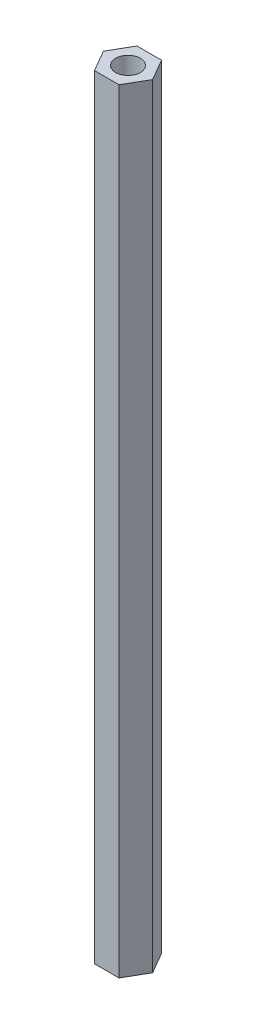
ISO-10303-21;
HEADER;
FILE_DESCRIPTION(('STEP AP214'),'2;1');
FILE_NAME('part.step','',(''),(''),'','','');
FILE_SCHEMA(('AUTOMOTIVE_DESIGN { 1 0 10303 214 1 1 1 1 }'));
ENDSEC;
DATA;
#1=APPLICATION_CONTEXT('core data for automotive mechanical design processes');
#2=APPLICATION_PROTOCOL_DEFINITION('international standard','automotive_design',2000,#1);
#3=PRODUCT_CONTEXT('',#1,'mechanical');
#4=PRODUCT('Part','Part','',(#3));
#5=PRODUCT_RELATED_PRODUCT_CATEGORY('part','',(#4));
#6=PRODUCT_DEFINITION_FORMATION('','',#4);
#7=PRODUCT_DEFINITION_CONTEXT('part definition',#1,'design');
#8=PRODUCT_DEFINITION('design','',#6,#7);
#9=PRODUCT_DEFINITION_SHAPE('','',#8);
#10=(LENGTH_UNIT() NAMED_UNIT(*) SI_UNIT(.MILLI.,.METRE.));
#11=(NAMED_UNIT(*) PLANE_ANGLE_UNIT() SI_UNIT($,.RADIAN.));
#12=(NAMED_UNIT(*) SI_UNIT($,.STERADIAN.) SOLID_ANGLE_UNIT());
#13=UNCERTAINTY_MEASURE_WITH_UNIT(LENGTH_MEASURE(1.E-05),#10,'distance_accuracy_value','');
#14=(GEOMETRIC_REPRESENTATION_CONTEXT(3) GLOBAL_UNCERTAINTY_ASSIGNED_CONTEXT((#13)) GLOBAL_UNIT_ASSIGNED_CONTEXT((#10,
#11,#12)) REPRESENTATION_CONTEXT('',''));
#15=CARTESIAN_POINT('',(0.,0.,0.));
#16=DIRECTION('',(0.,0.,1.));
#17=DIRECTION('',(1.,0.,0.));
#18=AXIS2_PLACEMENT_3D('',#15,#16,#17);
#19=CARTESIAN_POINT('',(1.58771324027147,100.,2.75));
#20=DIRECTION('',(-0.866025403784439,0.,-0.5));
#21=DIRECTION('',(-0.5,0.,0.866025403784439));
#22=AXIS2_PLACEMENT_3D('',#19,#20,#21);
#23=PLANE('',#22);
#24=DIRECTION('',(0.5,0.,-0.866025403784439));
#25=VECTOR('',#24,1.);
#26=CARTESIAN_POINT('',(1.58771324027147,0.,2.75));
#27=LINE('',#26,#25);
#28=CARTESIAN_POINT('',(1.58771324027147,0.,2.75));
#29=VERTEX_POINT('',#28);
#30=CARTESIAN_POINT('',(3.17542648054294,0.,0.));
#31=VERTEX_POINT('',#30);
#32=EDGE_CURVE('E118',#29,#31,#27,.T.);
#33=ORIENTED_EDGE('',*,*,#32,.T.);
#34=DIRECTION('',(0.,-1.,0.));
#35=VECTOR('',#34,1.);
#36=CARTESIAN_POINT('',(3.17542648054294,100.,0.));
#37=LINE('',#36,#35);
#38=CARTESIAN_POINT('',(3.17542648054294,100.,0.));
#39=VERTEX_POINT('',#38);
#40=EDGE_CURVE('E11',#39,#31,#37,.T.);
#41=ORIENTED_EDGE('',*,*,#40,.F.);
#42=DIRECTION('',(0.5,0.,-0.866025403784439));
#43=VECTOR('',#42,1.);
#44=CARTESIAN_POINT('',(1.58771324027147,100.,2.75));
#45=LINE('',#44,#43);
#46=CARTESIAN_POINT('',(1.58771324027147,100.,2.75));
#47=VERTEX_POINT('',#46);
#48=EDGE_CURVE('E129',#47,#39,#45,.T.);
#49=ORIENTED_EDGE('',*,*,#48,.F.);
#50=DIRECTION('',(0.,-1.,0.));
#51=VECTOR('',#50,1.);
#52=CARTESIAN_POINT('',(1.58771324027147,100.,2.75));
#53=LINE('',#52,#51);
#54=EDGE_CURVE('E114',#47,#29,#53,.T.);
#55=ORIENTED_EDGE('',*,*,#54,.T.);
#56=EDGE_LOOP('',(#33,#41,#49,#55));
#57=FACE_BOUND('',#56,.T.);
#58=ADVANCED_FACE('F34',(#57),#23,.F.);
#59=CARTESIAN_POINT('',(3.17542648054294,100.,0.));
#60=DIRECTION('',(-0.866025403784438,0.,0.5));
#61=DIRECTION('',(0.5,0.,0.866025403784439));
#62=AXIS2_PLACEMENT_3D('',#59,#60,#61);
#63=PLANE('',#62);
#64=DIRECTION('',(-0.5,0.,-0.866025403784438));
#65=VECTOR('',#64,1.);
#66=CARTESIAN_POINT('',(3.17542648054294,0.,0.));
#67=LINE('',#66,#65);
#68=CARTESIAN_POINT('',(1.58771324027147,0.,-2.75));
#69=VERTEX_POINT('',#68);
#70=EDGE_CURVE('E121',#31,#69,#67,.T.);
#71=ORIENTED_EDGE('',*,*,#70,.T.);
#72=DIRECTION('',(0.,-1.,0.));
#73=VECTOR('',#72,1.);
#74=CARTESIAN_POINT('',(1.58771324027147,100.,-2.75));
#75=LINE('',#74,#73);
#76=CARTESIAN_POINT('',(1.58771324027147,100.,-2.75));
#77=VERTEX_POINT('',#76);
#78=EDGE_CURVE('E42',#77,#69,#75,.T.);
#79=ORIENTED_EDGE('',*,*,#78,.F.);
#80=DIRECTION('',(-0.5,0.,-0.866025403784438));
#81=VECTOR('',#80,1.);
#82=CARTESIAN_POINT('',(3.17542648054294,100.,0.));
#83=LINE('',#82,#81);
#84=EDGE_CURVE('E87',#39,#77,#83,.T.);
#85=ORIENTED_EDGE('',*,*,#84,.F.);
#86=ORIENTED_EDGE('',*,*,#40,.T.);
#87=EDGE_LOOP('',(#71,#79,#85,#86));
#88=FACE_BOUND('',#87,.T.);
#89=ADVANCED_FACE('F154',(#88),#63,.F.);
#90=CARTESIAN_POINT('',(1.58771324027147,100.,-2.75));
#91=DIRECTION('',(0.,0.,1.));
#92=DIRECTION('',(1.,0.,0.));
#93=AXIS2_PLACEMENT_3D('',#90,#91,#92);
#94=PLANE('',#93);
#95=DIRECTION('',(-1.,0.,0.));
#96=VECTOR('',#95,1.);
#97=CARTESIAN_POINT('',(1.58771324027147,0.,-2.75));
#98=LINE('',#97,#96);
#99=CARTESIAN_POINT('',(-1.58771324027147,0.,-2.75));
#100=VERTEX_POINT('',#99);
#101=EDGE_CURVE('E124',#69,#100,#98,.T.);
#102=ORIENTED_EDGE('',*,*,#101,.T.);
#103=DIRECTION('',(0.,-1.,0.));
#104=VECTOR('',#103,1.);
#105=CARTESIAN_POINT('',(-1.58771324027147,100.,-2.75));
#106=LINE('',#105,#104);
#107=CARTESIAN_POINT('',(-1.58771324027147,100.,-2.75));
#108=VERTEX_POINT('',#107);
#109=EDGE_CURVE('E109',#108,#100,#106,.T.);
#110=ORIENTED_EDGE('',*,*,#109,.F.);
#111=DIRECTION('',(-1.,0.,0.));
#112=VECTOR('',#111,1.);
#113=CARTESIAN_POINT('',(1.58771324027147,100.,-2.75));
#114=LINE('',#113,#112);
#115=EDGE_CURVE('E100',#77,#108,#114,.T.);
#116=ORIENTED_EDGE('',*,*,#115,.F.);
#117=ORIENTED_EDGE('',*,*,#78,.T.);
#118=EDGE_LOOP('',(#102,#110,#116,#117));
#119=FACE_BOUND('',#118,.T.);
#120=ADVANCED_FACE('F135',(#119),#94,.F.);
#121=CARTESIAN_POINT('',(-1.58771324027147,100.,-2.75));
#122=DIRECTION('',(0.866025403784439,0.,0.5));
#123=DIRECTION('',(0.5,0.,-0.866025403784439));
#124=AXIS2_PLACEMENT_3D('',#121,#122,#123);
#125=PLANE('',#124);
#126=DIRECTION('',(-0.5,0.,0.866025403784439));
#127=VECTOR('',#126,1.);
#128=CARTESIAN_POINT('',(-1.58771324027147,0.,-2.75));
#129=LINE('',#128,#127);
#130=CARTESIAN_POINT('',(-3.17542648054294,0.,0.));
#131=VERTEX_POINT('',#130);
#132=EDGE_CURVE('E108',#100,#131,#129,.T.);
#133=ORIENTED_EDGE('',*,*,#132,.T.);
#134=DIRECTION('',(0.,-1.,0.));
#135=VECTOR('',#134,1.);
#136=CARTESIAN_POINT('',(-3.17542648054294,100.,0.));
#137=LINE('',#136,#135);
#138=CARTESIAN_POINT('',(-3.17542648054294,100.,0.));
#139=VERTEX_POINT('',#138);
#140=EDGE_CURVE('E105',#139,#131,#137,.T.);
#141=ORIENTED_EDGE('',*,*,#140,.F.);
#142=DIRECTION('',(-0.5,0.,0.866025403784439));
#143=VECTOR('',#142,1.);
#144=CARTESIAN_POINT('',(-1.58771324027147,100.,-2.75));
#145=LINE('',#144,#143);
#146=EDGE_CURVE('E94',#108,#139,#145,.T.);
#147=ORIENTED_EDGE('',*,*,#146,.F.);
#148=ORIENTED_EDGE('',*,*,#109,.T.);
#149=EDGE_LOOP('',(#133,#141,#147,#148));
#150=FACE_BOUND('',#149,.T.);
#151=ADVANCED_FACE('F106',(#150),#125,.F.);
#152=CARTESIAN_POINT('',(-3.17542648054294,100.,0.));
#153=DIRECTION('',(0.866025403784439,0.,-0.5));
#154=DIRECTION('',(-0.5,0.,-0.866025403784439));
#155=AXIS2_PLACEMENT_3D('',#152,#153,#154);
#156=PLANE('',#155);
#157=DIRECTION('',(0.5,0.,0.866025403784439));
#158=VECTOR('',#157,1.);
#159=CARTESIAN_POINT('',(-3.17542648054294,0.,0.));
#160=LINE('',#159,#158);
#161=CARTESIAN_POINT('',(-1.58771324027147,0.,2.75));
#162=VERTEX_POINT('',#161);
#163=EDGE_CURVE('E73',#131,#162,#160,.T.);
#164=ORIENTED_EDGE('',*,*,#163,.T.);
#165=DIRECTION('',(0.,-1.,0.));
#166=VECTOR('',#165,1.);
#167=CARTESIAN_POINT('',(-1.58771324027147,100.,2.75));
#168=LINE('',#167,#166);
#169=CARTESIAN_POINT('',(-1.58771324027147,100.,2.75));
#170=VERTEX_POINT('',#169);
#171=EDGE_CURVE('E110',#170,#162,#168,.T.);
#172=ORIENTED_EDGE('',*,*,#171,.F.);
#173=DIRECTION('',(0.5,0.,0.866025403784439));
#174=VECTOR('',#173,1.);
#175=CARTESIAN_POINT('',(-3.17542648054294,100.,0.));
#176=LINE('',#175,#174);
#177=EDGE_CURVE('E98',#139,#170,#176,.T.);
#178=ORIENTED_EDGE('',*,*,#177,.F.);
#179=ORIENTED_EDGE('',*,*,#140,.T.);
#180=EDGE_LOOP('',(#164,#172,#178,#179));
#181=FACE_BOUND('',#180,.T.);
#182=ADVANCED_FACE('F112',(#181),#156,.F.);
#183=CARTESIAN_POINT('',(-1.58771324027147,100.,2.75));
#184=DIRECTION('',(0.,0.,-1.));
#185=DIRECTION('',(-1.,0.,0.));
#186=AXIS2_PLACEMENT_3D('',#183,#184,#185);
#187=PLANE('',#186);
#188=DIRECTION('',(1.,0.,0.));
#189=VECTOR('',#188,1.);
#190=CARTESIAN_POINT('',(-1.58771324027147,0.,2.75));
#191=LINE('',#190,#189);
#192=EDGE_CURVE('E79',#162,#29,#191,.T.);
#193=ORIENTED_EDGE('',*,*,#192,.T.);
#194=ORIENTED_EDGE('',*,*,#54,.F.);
#195=DIRECTION('',(1.,0.,0.));
#196=VECTOR('',#195,1.);
#197=CARTESIAN_POINT('',(-1.58771324027147,100.,2.75));
#198=LINE('',#197,#196);
#199=EDGE_CURVE('E50',#170,#47,#198,.T.);
#200=ORIENTED_EDGE('',*,*,#199,.F.);
#201=ORIENTED_EDGE('',*,*,#171,.T.);
#202=EDGE_LOOP('',(#193,#194,#200,#201));
#203=FACE_BOUND('',#202,.T.);
#204=ADVANCED_FACE('F142',(#203),#187,.F.);
#205=CARTESIAN_POINT('',(0.,100.,0.));
#206=DIRECTION('',(0.,1.,0.));
#207=DIRECTION('',(0.,0.,1.));
#208=AXIS2_PLACEMENT_3D('',#205,#206,#207);
#209=PLANE('',#208);
#210=CARTESIAN_POINT('',(0.,100.,0.));
#211=DIRECTION('',(0.,1.,0.));
#212=DIRECTION('',(0.,0.,1.));
#213=AXIS2_PLACEMENT_3D('',#210,#211,#212);
#214=CIRCLE('',#213,1.6);
#215=CARTESIAN_POINT('',(0.,100.,1.6));
#216=VERTEX_POINT('',#215);
#217=EDGE_CURVE('E209',#216,#216,#214,.T.);
#218=ORIENTED_EDGE('',*,*,#217,.F.);
#219=EDGE_LOOP('',(#218));
#220=FACE_BOUND('',#219,.T.);
#221=ORIENTED_EDGE('',*,*,#48,.T.);
#222=ORIENTED_EDGE('',*,*,#84,.T.);
#223=ORIENTED_EDGE('',*,*,#115,.T.);
#224=ORIENTED_EDGE('',*,*,#146,.T.);
#225=ORIENTED_EDGE('',*,*,#177,.T.);
#226=ORIENTED_EDGE('',*,*,#199,.T.);
#227=EDGE_LOOP('',(#221,#222,#223,#224,#225,#226));
#228=FACE_BOUND('',#227,.T.);
#229=ADVANCED_FACE('F96',(#220,#228),#209,.T.);
#230=CARTESIAN_POINT('',(0.,0.,0.));
#231=DIRECTION('',(0.,1.,0.));
#232=DIRECTION('',(0.,0.,1.));
#233=AXIS2_PLACEMENT_3D('',#230,#231,#232);
#234=PLANE('',#233);
#235=CARTESIAN_POINT('',(0.,0.,0.));
#236=DIRECTION('',(0.,1.,0.));
#237=DIRECTION('',(0.,0.,1.));
#238=AXIS2_PLACEMENT_3D('',#235,#236,#237);
#239=CIRCLE('',#238,1.6);
#240=CARTESIAN_POINT('',(0.,0.,1.6));
#241=VERTEX_POINT('',#240);
#242=EDGE_CURVE('E122',#241,#241,#239,.T.);
#243=ORIENTED_EDGE('',*,*,#242,.T.);
#244=EDGE_LOOP('',(#243));
#245=FACE_BOUND('',#244,.T.);
#246=ORIENTED_EDGE('',*,*,#32,.F.);
#247=ORIENTED_EDGE('',*,*,#192,.F.);
#248=ORIENTED_EDGE('',*,*,#163,.F.);
#249=ORIENTED_EDGE('',*,*,#132,.F.);
#250=ORIENTED_EDGE('',*,*,#101,.F.);
#251=ORIENTED_EDGE('',*,*,#70,.F.);
#252=EDGE_LOOP('',(#246,#247,#248,#249,#250,#251));
#253=FACE_BOUND('',#252,.T.);
#254=ADVANCED_FACE('F138',(#245,#253),#234,.F.);
#255=CARTESIAN_POINT('',(0.,0.,0.));
#256=DIRECTION('',(0.,1.,0.));
#257=DIRECTION('',(0.,0.,1.));
#258=AXIS2_PLACEMENT_3D('',#255,#256,#257);
#259=CYLINDRICAL_SURFACE('',#258,1.6);
#260=ORIENTED_EDGE('',*,*,#242,.F.);
#261=EDGE_LOOP('',(#260));
#262=FACE_BOUND('',#261,.T.);
#263=ORIENTED_EDGE('',*,*,#217,.T.);
#264=EDGE_LOOP('',(#263));
#265=FACE_BOUND('',#264,.T.);
#266=ADVANCED_FACE('F191',(#262,#265),#259,.F.);
#267=CLOSED_SHELL('',(#58,#89,#120,#151,#182,#204,#229,#254,#266));
#268=MANIFOLD_SOLID_BREP('B2',#267);
#269=ADVANCED_BREP_SHAPE_REPRESENTATION('',(#18,#268),#14);
#270=SHAPE_DEFINITION_REPRESENTATION(#9,#269);
ENDSEC;
END-ISO-10303-21;
